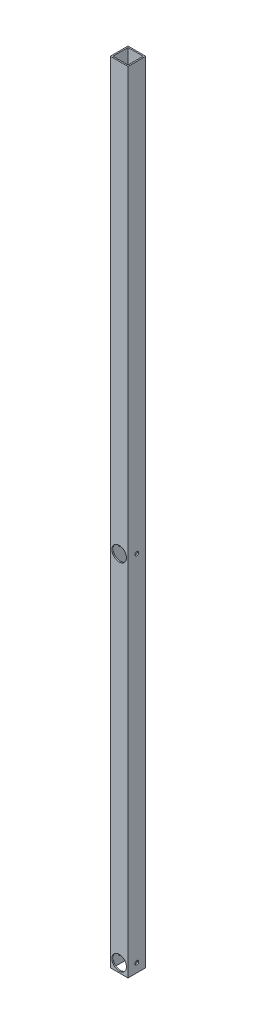
ISO-10303-21;
HEADER;
FILE_DESCRIPTION(('STEP AP214'),'2;1');
FILE_NAME('part.step','',(''),(''),'','','');
FILE_SCHEMA(('AUTOMOTIVE_DESIGN { 1 0 10303 214 1 1 1 1 }'));
ENDSEC;
DATA;
#1=APPLICATION_CONTEXT('core data for automotive mechanical design processes');
#2=APPLICATION_PROTOCOL_DEFINITION('international standard','automotive_design',2000,#1);
#3=PRODUCT_CONTEXT('',#1,'mechanical');
#4=PRODUCT('Part','Part','',(#3));
#5=PRODUCT_RELATED_PRODUCT_CATEGORY('part','',(#4));
#6=PRODUCT_DEFINITION_FORMATION('','',#4);
#7=PRODUCT_DEFINITION_CONTEXT('part definition',#1,'design');
#8=PRODUCT_DEFINITION('design','',#6,#7);
#9=PRODUCT_DEFINITION_SHAPE('','',#8);
#10=(LENGTH_UNIT() NAMED_UNIT(*) SI_UNIT(.MILLI.,.METRE.));
#11=(NAMED_UNIT(*) PLANE_ANGLE_UNIT() SI_UNIT($,.RADIAN.));
#12=(NAMED_UNIT(*) SI_UNIT($,.STERADIAN.) SOLID_ANGLE_UNIT());
#13=UNCERTAINTY_MEASURE_WITH_UNIT(LENGTH_MEASURE(1.E-05),#10,'distance_accuracy_value','');
#14=(GEOMETRIC_REPRESENTATION_CONTEXT(3) GLOBAL_UNCERTAINTY_ASSIGNED_CONTEXT((#13)) GLOBAL_UNIT_ASSIGNED_CONTEXT((#10,
#11,#12)) REPRESENTATION_CONTEXT('',''));
#15=CARTESIAN_POINT('',(0.,0.,0.));
#16=DIRECTION('',(0.,0.,1.));
#17=DIRECTION('',(1.,0.,0.));
#18=AXIS2_PLACEMENT_3D('',#15,#16,#17);
#19=CARTESIAN_POINT('',(0.,1981.2,0.));
#20=DIRECTION('',(0.,-1.,0.));
#21=DIRECTION('',(0.,0.,-1.));
#22=AXIS2_PLACEMENT_3D('',#19,#20,#21);
#23=PLANE('',#22);
#24=DIRECTION('',(0.,0.,1.));
#25=VECTOR('',#24,1.);
#26=CARTESIAN_POINT('',(0.,1981.2,0.));
#27=LINE('',#26,#25);
#28=CARTESIAN_POINT('',(0.,1981.2,-44.45));
#29=VERTEX_POINT('',#28);
#30=CARTESIAN_POINT('',(0.,1981.2,0.));
#31=VERTEX_POINT('',#30);
#32=EDGE_CURVE('E137',#29,#31,#27,.T.);
#33=ORIENTED_EDGE('',*,*,#32,.T.);
#34=DIRECTION('',(1.,0.,0.));
#35=VECTOR('',#34,1.);
#36=CARTESIAN_POINT('',(0.,1981.2,0.));
#37=LINE('',#36,#35);
#38=CARTESIAN_POINT('',(44.45,1981.2,0.));
#39=VERTEX_POINT('',#38);
#40=EDGE_CURVE('E140',#31,#39,#37,.T.);
#41=ORIENTED_EDGE('',*,*,#40,.T.);
#42=DIRECTION('',(0.,0.,-1.));
#43=VECTOR('',#42,1.);
#44=CARTESIAN_POINT('',(44.45,1981.2,0.));
#45=LINE('',#44,#43);
#46=CARTESIAN_POINT('',(44.45,1981.2,-44.45));
#47=VERTEX_POINT('',#46);
#48=EDGE_CURVE('E143',#39,#47,#45,.T.);
#49=ORIENTED_EDGE('',*,*,#48,.T.);
#50=DIRECTION('',(-1.,0.,0.));
#51=VECTOR('',#50,1.);
#52=CARTESIAN_POINT('',(0.,1981.2,-44.45));
#53=LINE('',#52,#51);
#54=EDGE_CURVE('E145',#47,#29,#53,.T.);
#55=ORIENTED_EDGE('',*,*,#54,.T.);
#56=EDGE_LOOP('',(#33,#41,#49,#55));
#57=FACE_BOUND('',#56,.T.);
#58=DIRECTION('',(1.,0.,0.));
#59=VECTOR('',#58,1.);
#60=CARTESIAN_POINT('',(3.175,1981.2,-3.175));
#61=LINE('',#60,#59);
#62=CARTESIAN_POINT('',(3.175,1981.2,-3.175));
#63=VERTEX_POINT('',#62);
#64=CARTESIAN_POINT('',(41.275,1981.2,-3.175));
#65=VERTEX_POINT('',#64);
#66=EDGE_CURVE('E99',#63,#65,#61,.T.);
#67=ORIENTED_EDGE('',*,*,#66,.F.);
#68=DIRECTION('',(0.,0.,1.));
#69=VECTOR('',#68,1.);
#70=CARTESIAN_POINT('',(3.175,1981.2,-3.175));
#71=LINE('',#70,#69);
#72=CARTESIAN_POINT('',(3.175,1981.2,-41.275));
#73=VERTEX_POINT('',#72);
#74=EDGE_CURVE('E121',#73,#63,#71,.T.);
#75=ORIENTED_EDGE('',*,*,#74,.F.);
#76=DIRECTION('',(-1.,0.,0.));
#77=VECTOR('',#76,1.);
#78=CARTESIAN_POINT('',(3.175,1981.2,-41.275));
#79=LINE('',#78,#77);
#80=CARTESIAN_POINT('',(41.275,1981.2,-41.275));
#81=VERTEX_POINT('',#80);
#82=EDGE_CURVE('E119',#81,#73,#79,.T.);
#83=ORIENTED_EDGE('',*,*,#82,.F.);
#84=DIRECTION('',(0.,0.,-1.));
#85=VECTOR('',#84,1.);
#86=CARTESIAN_POINT('',(41.275,1981.2,-3.175));
#87=LINE('',#86,#85);
#88=EDGE_CURVE('E107',#65,#81,#87,.T.);
#89=ORIENTED_EDGE('',*,*,#88,.F.);
#90=EDGE_LOOP('',(#67,#75,#83,#89));
#91=FACE_BOUND('',#90,.T.);
#92=ADVANCED_FACE('F32',(#57,#91),#23,.F.);
#93=CARTESIAN_POINT('',(0.,0.,0.));
#94=DIRECTION('',(0.,-1.,0.));
#95=DIRECTION('',(0.,0.,-1.));
#96=AXIS2_PLACEMENT_3D('',#93,#94,#95);
#97=PLANE('',#96);
#98=DIRECTION('',(0.,0.,1.));
#99=VECTOR('',#98,1.);
#100=CARTESIAN_POINT('',(0.,0.,0.));
#101=LINE('',#100,#99);
#102=CARTESIAN_POINT('',(0.,0.,-44.45));
#103=VERTEX_POINT('',#102);
#104=CARTESIAN_POINT('',(0.,0.,0.));
#105=VERTEX_POINT('',#104);
#106=EDGE_CURVE('E115',#103,#105,#101,.T.);
#107=ORIENTED_EDGE('',*,*,#106,.F.);
#108=DIRECTION('',(-1.,0.,0.));
#109=VECTOR('',#108,1.);
#110=CARTESIAN_POINT('',(0.,0.,-44.45));
#111=LINE('',#110,#109);
#112=CARTESIAN_POINT('',(44.45,0.,-44.45));
#113=VERTEX_POINT('',#112);
#114=EDGE_CURVE('E141',#113,#103,#111,.T.);
#115=ORIENTED_EDGE('',*,*,#114,.F.);
#116=DIRECTION('',(0.,0.,-1.));
#117=VECTOR('',#116,1.);
#118=CARTESIAN_POINT('',(44.45,0.,0.));
#119=LINE('',#118,#117);
#120=CARTESIAN_POINT('',(44.45,0.,0.));
#121=VERTEX_POINT('',#120);
#122=EDGE_CURVE('E152',#121,#113,#119,.T.);
#123=ORIENTED_EDGE('',*,*,#122,.F.);
#124=DIRECTION('',(1.,0.,0.));
#125=VECTOR('',#124,1.);
#126=CARTESIAN_POINT('',(0.,0.,0.));
#127=LINE('',#126,#125);
#128=EDGE_CURVE('E150',#105,#121,#127,.T.);
#129=ORIENTED_EDGE('',*,*,#128,.F.);
#130=EDGE_LOOP('',(#107,#115,#123,#129));
#131=FACE_BOUND('',#130,.T.);
#132=DIRECTION('',(0.,0.,1.));
#133=VECTOR('',#132,1.);
#134=CARTESIAN_POINT('',(3.175,0.,-3.175));
#135=LINE('',#134,#133);
#136=CARTESIAN_POINT('',(3.175,0.,-41.275));
#137=VERTEX_POINT('',#136);
#138=CARTESIAN_POINT('',(3.175,0.,-3.175));
#139=VERTEX_POINT('',#138);
#140=EDGE_CURVE('E108',#137,#139,#135,.T.);
#141=ORIENTED_EDGE('',*,*,#140,.T.);
#142=DIRECTION('',(1.,0.,0.));
#143=VECTOR('',#142,1.);
#144=CARTESIAN_POINT('',(3.175,0.,-3.175));
#145=LINE('',#144,#143);
#146=CARTESIAN_POINT('',(41.275,0.,-3.175));
#147=VERTEX_POINT('',#146);
#148=EDGE_CURVE('E57',#139,#147,#145,.T.);
#149=ORIENTED_EDGE('',*,*,#148,.T.);
#150=DIRECTION('',(0.,0.,-1.));
#151=VECTOR('',#150,1.);
#152=CARTESIAN_POINT('',(41.275,0.,-3.175));
#153=LINE('',#152,#151);
#154=CARTESIAN_POINT('',(41.275,0.,-41.275));
#155=VERTEX_POINT('',#154);
#156=EDGE_CURVE('E114',#147,#155,#153,.T.);
#157=ORIENTED_EDGE('',*,*,#156,.T.);
#158=DIRECTION('',(-1.,0.,0.));
#159=VECTOR('',#158,1.);
#160=CARTESIAN_POINT('',(3.175,0.,-41.275));
#161=LINE('',#160,#159);
#162=EDGE_CURVE('E129',#155,#137,#161,.T.);
#163=ORIENTED_EDGE('',*,*,#162,.T.);
#164=EDGE_LOOP('',(#141,#149,#157,#163));
#165=FACE_BOUND('',#164,.T.);
#166=ADVANCED_FACE('F240',(#131,#165),#97,.T.);
#167=CARTESIAN_POINT('',(0.,1981.2,0.));
#168=DIRECTION('',(1.,0.,0.));
#169=DIRECTION('',(0.,0.,-1.));
#170=AXIS2_PLACEMENT_3D('',#167,#168,#169);
#171=PLANE('',#170);
#172=CARTESIAN_POINT('',(0.,22.225,-22.225));
#173=DIRECTION('',(1.,0.,0.));
#174=DIRECTION('',(0.,0.,-1.));
#175=AXIS2_PLACEMENT_3D('',#172,#173,#174);
#176=CIRCLE('',#175,4.7625);
#177=CARTESIAN_POINT('',(0.,22.225,-26.9875));
#178=VERTEX_POINT('',#177);
#179=EDGE_CURVE('E172',#178,#178,#176,.T.);
#180=ORIENTED_EDGE('',*,*,#179,.T.);
#181=EDGE_LOOP('',(#180));
#182=FACE_BOUND('',#181,.T.);
#183=CARTESIAN_POINT('',(0.,911.225,-22.225));
#184=DIRECTION('',(1.,0.,0.));
#185=DIRECTION('',(0.,0.,-1.));
#186=AXIS2_PLACEMENT_3D('',#183,#184,#185);
#187=CIRCLE('',#186,4.76250000000002);
#188=CARTESIAN_POINT('',(0.,911.225,-26.9875));
#189=VERTEX_POINT('',#188);
#190=EDGE_CURVE('E183',#189,#189,#187,.T.);
#191=ORIENTED_EDGE('',*,*,#190,.T.);
#192=EDGE_LOOP('',(#191));
#193=FACE_BOUND('',#192,.T.);
#194=ORIENTED_EDGE('',*,*,#106,.T.);
#195=DIRECTION('',(0.,-1.,0.));
#196=VECTOR('',#195,1.);
#197=CARTESIAN_POINT('',(0.,1981.2,0.));
#198=LINE('',#197,#196);
#199=EDGE_CURVE('E11',#31,#105,#198,.T.);
#200=ORIENTED_EDGE('',*,*,#199,.F.);
#201=ORIENTED_EDGE('',*,*,#32,.F.);
#202=DIRECTION('',(0.,-1.,0.));
#203=VECTOR('',#202,1.);
#204=CARTESIAN_POINT('',(0.,1981.2,-44.45));
#205=LINE('',#204,#203);
#206=EDGE_CURVE('E147',#29,#103,#205,.T.);
#207=ORIENTED_EDGE('',*,*,#206,.T.);
#208=EDGE_LOOP('',(#194,#200,#201,#207));
#209=FACE_BOUND('',#208,.T.);
#210=ADVANCED_FACE('F34',(#182,#193,#209),#171,.F.);
#211=CARTESIAN_POINT('',(0.,1981.2,0.));
#212=DIRECTION('',(0.,0.,-1.));
#213=DIRECTION('',(-1.,0.,0.));
#214=AXIS2_PLACEMENT_3D('',#211,#212,#213);
#215=PLANE('',#214);
#216=CARTESIAN_POINT('',(22.225,22.225,0.));
#217=DIRECTION('',(0.,0.,1.));
#218=DIRECTION('',(1.,0.,0.));
#219=AXIS2_PLACEMENT_3D('',#216,#217,#218);
#220=CIRCLE('',#219,18.25625);
#221=CARTESIAN_POINT('',(40.48125,22.225,0.));
#222=VERTEX_POINT('',#221);
#223=EDGE_CURVE('E197',#222,#222,#220,.T.);
#224=ORIENTED_EDGE('',*,*,#223,.F.);
#225=EDGE_LOOP('',(#224));
#226=FACE_BOUND('',#225,.T.);
#227=CARTESIAN_POINT('',(22.225,911.225,0.));
#228=DIRECTION('',(0.,0.,1.));
#229=DIRECTION('',(1.,0.,0.));
#230=AXIS2_PLACEMENT_3D('',#227,#228,#229);
#231=CIRCLE('',#230,18.25625);
#232=CARTESIAN_POINT('',(40.48125,911.225,0.));
#233=VERTEX_POINT('',#232);
#234=EDGE_CURVE('E194',#233,#233,#231,.T.);
#235=ORIENTED_EDGE('',*,*,#234,.F.);
#236=EDGE_LOOP('',(#235));
#237=FACE_BOUND('',#236,.T.);
#238=ORIENTED_EDGE('',*,*,#128,.T.);
#239=DIRECTION('',(0.,-1.,0.));
#240=VECTOR('',#239,1.);
#241=CARTESIAN_POINT('',(44.45,1981.2,0.));
#242=LINE('',#241,#240);
#243=EDGE_CURVE('E41',#39,#121,#242,.T.);
#244=ORIENTED_EDGE('',*,*,#243,.F.);
#245=ORIENTED_EDGE('',*,*,#40,.F.);
#246=ORIENTED_EDGE('',*,*,#199,.T.);
#247=EDGE_LOOP('',(#238,#244,#245,#246));
#248=FACE_BOUND('',#247,.T.);
#249=ADVANCED_FACE('F226',(#226,#237,#248),#215,.F.);
#250=CARTESIAN_POINT('',(44.45,1981.2,0.));
#251=DIRECTION('',(-1.,0.,0.));
#252=DIRECTION('',(0.,0.,1.));
#253=AXIS2_PLACEMENT_3D('',#250,#251,#252);
#254=PLANE('',#253);
#255=CARTESIAN_POINT('',(44.45,22.225,-22.225));
#256=DIRECTION('',(1.,0.,0.));
#257=DIRECTION('',(0.,0.,-1.));
#258=AXIS2_PLACEMENT_3D('',#255,#256,#257);
#259=CIRCLE('',#258,4.7625);
#260=CARTESIAN_POINT('',(44.45,22.225,-26.9875));
#261=VERTEX_POINT('',#260);
#262=EDGE_CURVE('E178',#261,#261,#259,.T.);
#263=ORIENTED_EDGE('',*,*,#262,.F.);
#264=EDGE_LOOP('',(#263));
#265=FACE_BOUND('',#264,.T.);
#266=CARTESIAN_POINT('',(44.45,911.225,-22.225));
#267=DIRECTION('',(1.,0.,0.));
#268=DIRECTION('',(0.,0.,-1.));
#269=AXIS2_PLACEMENT_3D('',#266,#267,#268);
#270=CIRCLE('',#269,4.76250000000002);
#271=CARTESIAN_POINT('',(44.45,911.225,-26.9875));
#272=VERTEX_POINT('',#271);
#273=EDGE_CURVE('E188',#272,#272,#270,.T.);
#274=ORIENTED_EDGE('',*,*,#273,.F.);
#275=EDGE_LOOP('',(#274));
#276=FACE_BOUND('',#275,.T.);
#277=ORIENTED_EDGE('',*,*,#122,.T.);
#278=DIRECTION('',(0.,-1.,0.));
#279=VECTOR('',#278,1.);
#280=CARTESIAN_POINT('',(44.45,1981.2,-44.45));
#281=LINE('',#280,#279);
#282=EDGE_CURVE('E157',#47,#113,#281,.T.);
#283=ORIENTED_EDGE('',*,*,#282,.F.);
#284=ORIENTED_EDGE('',*,*,#48,.F.);
#285=ORIENTED_EDGE('',*,*,#243,.T.);
#286=EDGE_LOOP('',(#277,#283,#284,#285));
#287=FACE_BOUND('',#286,.T.);
#288=ADVANCED_FACE('F229',(#265,#276,#287),#254,.F.);
#289=CARTESIAN_POINT('',(0.,1981.2,-44.45));
#290=DIRECTION('',(0.,0.,1.));
#291=DIRECTION('',(1.,0.,0.));
#292=AXIS2_PLACEMENT_3D('',#289,#290,#291);
#293=PLANE('',#292);
#294=CARTESIAN_POINT('',(22.225,22.225,-44.45));
#295=DIRECTION('',(0.,0.,1.));
#296=DIRECTION('',(1.,0.,0.));
#297=AXIS2_PLACEMENT_3D('',#294,#295,#296);
#298=CIRCLE('',#297,18.25625);
#299=CARTESIAN_POINT('',(40.48125,22.225,-44.45));
#300=VERTEX_POINT('',#299);
#301=EDGE_CURVE('E166',#300,#300,#298,.T.);
#302=ORIENTED_EDGE('',*,*,#301,.T.);
#303=EDGE_LOOP('',(#302));
#304=FACE_BOUND('',#303,.T.);
#305=CARTESIAN_POINT('',(22.225,911.225,-44.45));
#306=DIRECTION('',(0.,0.,1.));
#307=DIRECTION('',(1.,0.,0.));
#308=AXIS2_PLACEMENT_3D('',#305,#306,#307);
#309=CIRCLE('',#308,18.25625);
#310=CARTESIAN_POINT('',(40.48125,911.225,-44.45));
#311=VERTEX_POINT('',#310);
#312=EDGE_CURVE('E200',#311,#311,#309,.T.);
#313=ORIENTED_EDGE('',*,*,#312,.T.);
#314=EDGE_LOOP('',(#313));
#315=FACE_BOUND('',#314,.T.);
#316=ORIENTED_EDGE('',*,*,#114,.T.);
#317=ORIENTED_EDGE('',*,*,#206,.F.);
#318=ORIENTED_EDGE('',*,*,#54,.F.);
#319=ORIENTED_EDGE('',*,*,#282,.T.);
#320=EDGE_LOOP('',(#316,#317,#318,#319));
#321=FACE_BOUND('',#320,.T.);
#322=ADVANCED_FACE('F214',(#304,#315,#321),#293,.F.);
#323=CARTESIAN_POINT('',(3.175,1981.2,-3.175));
#324=DIRECTION('',(0.,0.,-1.));
#325=DIRECTION('',(-1.,0.,0.));
#326=AXIS2_PLACEMENT_3D('',#323,#324,#325);
#327=PLANE('',#326);
#328=CARTESIAN_POINT('',(22.225,22.225,-3.175));
#329=DIRECTION('',(0.,0.,-1.));
#330=DIRECTION('',(-1.,0.,0.));
#331=AXIS2_PLACEMENT_3D('',#328,#329,#330);
#332=CIRCLE('',#331,18.25625);
#333=CARTESIAN_POINT('',(3.96875,22.225,-3.175));
#334=VERTEX_POINT('',#333);
#335=EDGE_CURVE('E127',#334,#334,#332,.T.);
#336=ORIENTED_EDGE('',*,*,#335,.F.);
#337=EDGE_LOOP('',(#336));
#338=FACE_BOUND('',#337,.T.);
#339=CARTESIAN_POINT('',(22.225,911.225,-3.175));
#340=DIRECTION('',(0.,0.,-1.));
#341=DIRECTION('',(-1.,0.,0.));
#342=AXIS2_PLACEMENT_3D('',#339,#340,#341);
#343=CIRCLE('',#342,18.25625);
#344=CARTESIAN_POINT('',(3.96875,911.225,-3.175));
#345=VERTEX_POINT('',#344);
#346=EDGE_CURVE('E165',#345,#345,#343,.T.);
#347=ORIENTED_EDGE('',*,*,#346,.F.);
#348=EDGE_LOOP('',(#347));
#349=FACE_BOUND('',#348,.T.);
#350=ORIENTED_EDGE('',*,*,#148,.F.);
#351=DIRECTION('',(0.,-1.,0.));
#352=VECTOR('',#351,1.);
#353=CARTESIAN_POINT('',(3.175,1981.2,-3.175));
#354=LINE('',#353,#352);
#355=EDGE_CURVE('E103',#63,#139,#354,.T.);
#356=ORIENTED_EDGE('',*,*,#355,.F.);
#357=ORIENTED_EDGE('',*,*,#66,.T.);
#358=DIRECTION('',(0.,-1.,0.));
#359=VECTOR('',#358,1.);
#360=CARTESIAN_POINT('',(41.275,1981.2,-3.175));
#361=LINE('',#360,#359);
#362=EDGE_CURVE('E102',#65,#147,#361,.T.);
#363=ORIENTED_EDGE('',*,*,#362,.T.);
#364=EDGE_LOOP('',(#350,#356,#357,#363));
#365=FACE_BOUND('',#364,.T.);
#366=ADVANCED_FACE('F101',(#338,#349,#365),#327,.T.);
#367=CARTESIAN_POINT('',(41.275,1981.2,-3.175));
#368=DIRECTION('',(-1.,0.,0.));
#369=DIRECTION('',(0.,0.,1.));
#370=AXIS2_PLACEMENT_3D('',#367,#368,#369);
#371=PLANE('',#370);
#372=CARTESIAN_POINT('',(41.275,22.225,-22.225));
#373=DIRECTION('',(-1.,0.,0.));
#374=DIRECTION('',(0.,0.,1.));
#375=AXIS2_PLACEMENT_3D('',#372,#373,#374);
#376=CIRCLE('',#375,4.7625);
#377=CARTESIAN_POINT('',(41.275,22.225,-17.4625));
#378=VERTEX_POINT('',#377);
#379=EDGE_CURVE('E191',#378,#378,#376,.T.);
#380=ORIENTED_EDGE('',*,*,#379,.F.);
#381=EDGE_LOOP('',(#380));
#382=FACE_BOUND('',#381,.T.);
#383=CARTESIAN_POINT('',(41.275,911.225,-22.225));
#384=DIRECTION('',(-1.,0.,0.));
#385=DIRECTION('',(0.,0.,1.));
#386=AXIS2_PLACEMENT_3D('',#383,#384,#385);
#387=CIRCLE('',#386,4.76250000000002);
#388=CARTESIAN_POINT('',(41.275,911.225,-17.4625));
#389=VERTEX_POINT('',#388);
#390=EDGE_CURVE('E171',#389,#389,#387,.T.);
#391=ORIENTED_EDGE('',*,*,#390,.F.);
#392=EDGE_LOOP('',(#391));
#393=FACE_BOUND('',#392,.T.);
#394=ORIENTED_EDGE('',*,*,#156,.F.);
#395=ORIENTED_EDGE('',*,*,#362,.F.);
#396=ORIENTED_EDGE('',*,*,#88,.T.);
#397=DIRECTION('',(0.,-1.,0.));
#398=VECTOR('',#397,1.);
#399=CARTESIAN_POINT('',(41.275,1981.2,-41.275));
#400=LINE('',#399,#398);
#401=EDGE_CURVE('E116',#81,#155,#400,.T.);
#402=ORIENTED_EDGE('',*,*,#401,.T.);
#403=EDGE_LOOP('',(#394,#395,#396,#402));
#404=FACE_BOUND('',#403,.T.);
#405=ADVANCED_FACE('F111',(#382,#393,#404),#371,.T.);
#406=CARTESIAN_POINT('',(3.175,1981.2,-41.275));
#407=DIRECTION('',(0.,0.,1.));
#408=DIRECTION('',(1.,0.,0.));
#409=AXIS2_PLACEMENT_3D('',#406,#407,#408);
#410=PLANE('',#409);
#411=CARTESIAN_POINT('',(22.225,22.225,-41.275));
#412=DIRECTION('',(0.,0.,1.));
#413=DIRECTION('',(1.,0.,0.));
#414=AXIS2_PLACEMENT_3D('',#411,#412,#413);
#415=CIRCLE('',#414,18.25625);
#416=CARTESIAN_POINT('',(40.48125,22.225,-41.275));
#417=VERTEX_POINT('',#416);
#418=EDGE_CURVE('E167',#417,#417,#415,.T.);
#419=ORIENTED_EDGE('',*,*,#418,.F.);
#420=EDGE_LOOP('',(#419));
#421=FACE_BOUND('',#420,.T.);
#422=CARTESIAN_POINT('',(22.225,911.225,-41.275));
#423=DIRECTION('',(0.,0.,1.));
#424=DIRECTION('',(1.,0.,0.));
#425=AXIS2_PLACEMENT_3D('',#422,#423,#424);
#426=CIRCLE('',#425,18.25625);
#427=CARTESIAN_POINT('',(40.48125,911.225,-41.275));
#428=VERTEX_POINT('',#427);
#429=EDGE_CURVE('E162',#428,#428,#426,.T.);
#430=ORIENTED_EDGE('',*,*,#429,.F.);
#431=EDGE_LOOP('',(#430));
#432=FACE_BOUND('',#431,.T.);
#433=ORIENTED_EDGE('',*,*,#162,.F.);
#434=ORIENTED_EDGE('',*,*,#401,.F.);
#435=ORIENTED_EDGE('',*,*,#82,.T.);
#436=DIRECTION('',(0.,-1.,0.));
#437=VECTOR('',#436,1.);
#438=CARTESIAN_POINT('',(3.175,1981.2,-41.275));
#439=LINE('',#438,#437);
#440=EDGE_CURVE('E49',#73,#137,#439,.T.);
#441=ORIENTED_EDGE('',*,*,#440,.T.);
#442=EDGE_LOOP('',(#433,#434,#435,#441));
#443=FACE_BOUND('',#442,.T.);
#444=ADVANCED_FACE('F321',(#421,#432,#443),#410,.T.);
#445=CARTESIAN_POINT('',(3.175,1981.2,-3.175));
#446=DIRECTION('',(1.,0.,0.));
#447=DIRECTION('',(0.,0.,-1.));
#448=AXIS2_PLACEMENT_3D('',#445,#446,#447);
#449=PLANE('',#448);
#450=CARTESIAN_POINT('',(3.175,22.225,-22.225));
#451=DIRECTION('',(1.,0.,0.));
#452=DIRECTION('',(0.,0.,-1.));
#453=AXIS2_PLACEMENT_3D('',#450,#451,#452);
#454=CIRCLE('',#453,4.7625);
#455=CARTESIAN_POINT('',(3.175,22.225,-26.9875));
#456=VERTEX_POINT('',#455);
#457=EDGE_CURVE('E36',#456,#456,#454,.T.);
#458=ORIENTED_EDGE('',*,*,#457,.F.);
#459=EDGE_LOOP('',(#458));
#460=FACE_BOUND('',#459,.T.);
#461=CARTESIAN_POINT('',(3.175,911.225,-22.225));
#462=DIRECTION('',(1.,0.,0.));
#463=DIRECTION('',(0.,0.,-1.));
#464=AXIS2_PLACEMENT_3D('',#461,#462,#463);
#465=CIRCLE('',#464,4.76250000000002);
#466=CARTESIAN_POINT('',(3.175,911.225,-26.9875));
#467=VERTEX_POINT('',#466);
#468=EDGE_CURVE('E169',#467,#467,#465,.T.);
#469=ORIENTED_EDGE('',*,*,#468,.F.);
#470=EDGE_LOOP('',(#469));
#471=FACE_BOUND('',#470,.T.);
#472=ORIENTED_EDGE('',*,*,#140,.F.);
#473=ORIENTED_EDGE('',*,*,#440,.F.);
#474=ORIENTED_EDGE('',*,*,#74,.T.);
#475=ORIENTED_EDGE('',*,*,#355,.T.);
#476=EDGE_LOOP('',(#472,#473,#474,#475));
#477=FACE_BOUND('',#476,.T.);
#478=ADVANCED_FACE('F326',(#460,#471,#477),#449,.T.);
#479=CARTESIAN_POINT('',(22.225,911.225,-44.45));
#480=DIRECTION('',(0.,0.,1.));
#481=DIRECTION('',(1.,0.,0.));
#482=AXIS2_PLACEMENT_3D('',#479,#480,#481);
#483=CYLINDRICAL_SURFACE('',#482,18.25625);
#484=ORIENTED_EDGE('',*,*,#429,.T.);
#485=EDGE_LOOP('',(#484));
#486=FACE_BOUND('',#485,.T.);
#487=ORIENTED_EDGE('',*,*,#312,.F.);
#488=EDGE_LOOP('',(#487));
#489=FACE_BOUND('',#488,.T.);
#490=ADVANCED_FACE('F223',(#486,#489),#483,.F.);
#491=CARTESIAN_POINT('',(22.225,22.225,-44.45));
#492=DIRECTION('',(0.,0.,1.));
#493=DIRECTION('',(1.,0.,0.));
#494=AXIS2_PLACEMENT_3D('',#491,#492,#493);
#495=CYLINDRICAL_SURFACE('',#494,18.25625);
#496=ORIENTED_EDGE('',*,*,#418,.T.);
#497=EDGE_LOOP('',(#496));
#498=FACE_BOUND('',#497,.T.);
#499=ORIENTED_EDGE('',*,*,#301,.F.);
#500=EDGE_LOOP('',(#499));
#501=FACE_BOUND('',#500,.T.);
#502=ADVANCED_FACE('F221',(#498,#501),#495,.F.);
#503=ORIENTED_EDGE('',*,*,#346,.T.);
#504=EDGE_LOOP('',(#503));
#505=FACE_BOUND('',#504,.T.);
#506=ORIENTED_EDGE('',*,*,#234,.T.);
#507=EDGE_LOOP('',(#506));
#508=FACE_BOUND('',#507,.T.);
#509=ADVANCED_FACE('F218',(#505,#508),#483,.F.);
#510=ORIENTED_EDGE('',*,*,#335,.T.);
#511=EDGE_LOOP('',(#510));
#512=FACE_BOUND('',#511,.T.);
#513=ORIENTED_EDGE('',*,*,#223,.T.);
#514=EDGE_LOOP('',(#513));
#515=FACE_BOUND('',#514,.T.);
#516=ADVANCED_FACE('F209',(#512,#515),#495,.F.);
#517=CARTESIAN_POINT('',(0.,911.225,-22.225));
#518=DIRECTION('',(1.,0.,0.));
#519=DIRECTION('',(0.,0.,-1.));
#520=AXIS2_PLACEMENT_3D('',#517,#518,#519);
#521=CYLINDRICAL_SURFACE('',#520,4.76250000000002);
#522=ORIENTED_EDGE('',*,*,#468,.T.);
#523=EDGE_LOOP('',(#522));
#524=FACE_BOUND('',#523,.T.);
#525=ORIENTED_EDGE('',*,*,#190,.F.);
#526=EDGE_LOOP('',(#525));
#527=FACE_BOUND('',#526,.T.);
#528=ADVANCED_FACE('F273',(#524,#527),#521,.F.);
#529=CARTESIAN_POINT('',(0.,22.225,-22.225));
#530=DIRECTION('',(1.,0.,0.));
#531=DIRECTION('',(0.,0.,-1.));
#532=AXIS2_PLACEMENT_3D('',#529,#530,#531);
#533=CYLINDRICAL_SURFACE('',#532,4.7625);
#534=ORIENTED_EDGE('',*,*,#457,.T.);
#535=EDGE_LOOP('',(#534));
#536=FACE_BOUND('',#535,.T.);
#537=ORIENTED_EDGE('',*,*,#179,.F.);
#538=EDGE_LOOP('',(#537));
#539=FACE_BOUND('',#538,.T.);
#540=ADVANCED_FACE('F270',(#536,#539),#533,.F.);
#541=ORIENTED_EDGE('',*,*,#390,.T.);
#542=EDGE_LOOP('',(#541));
#543=FACE_BOUND('',#542,.T.);
#544=ORIENTED_EDGE('',*,*,#273,.T.);
#545=EDGE_LOOP('',(#544));
#546=FACE_BOUND('',#545,.T.);
#547=ADVANCED_FACE('F267',(#543,#546),#521,.F.);
#548=ORIENTED_EDGE('',*,*,#379,.T.);
#549=EDGE_LOOP('',(#548));
#550=FACE_BOUND('',#549,.T.);
#551=ORIENTED_EDGE('',*,*,#262,.T.);
#552=EDGE_LOOP('',(#551));
#553=FACE_BOUND('',#552,.T.);
#554=ADVANCED_FACE('F269',(#550,#553),#533,.F.);
#555=CLOSED_SHELL('',(#92,#166,#210,#249,#288,#322,#366,#405,#444,#478,#490,#502,#509,#516,#528,
#540,#547,#554));
#556=MANIFOLD_SOLID_BREP('B2',#555);
#557=ADVANCED_BREP_SHAPE_REPRESENTATION('',(#18,#556),#14);
#558=SHAPE_DEFINITION_REPRESENTATION(#9,#557);
ENDSEC;
END-ISO-10303-21;
